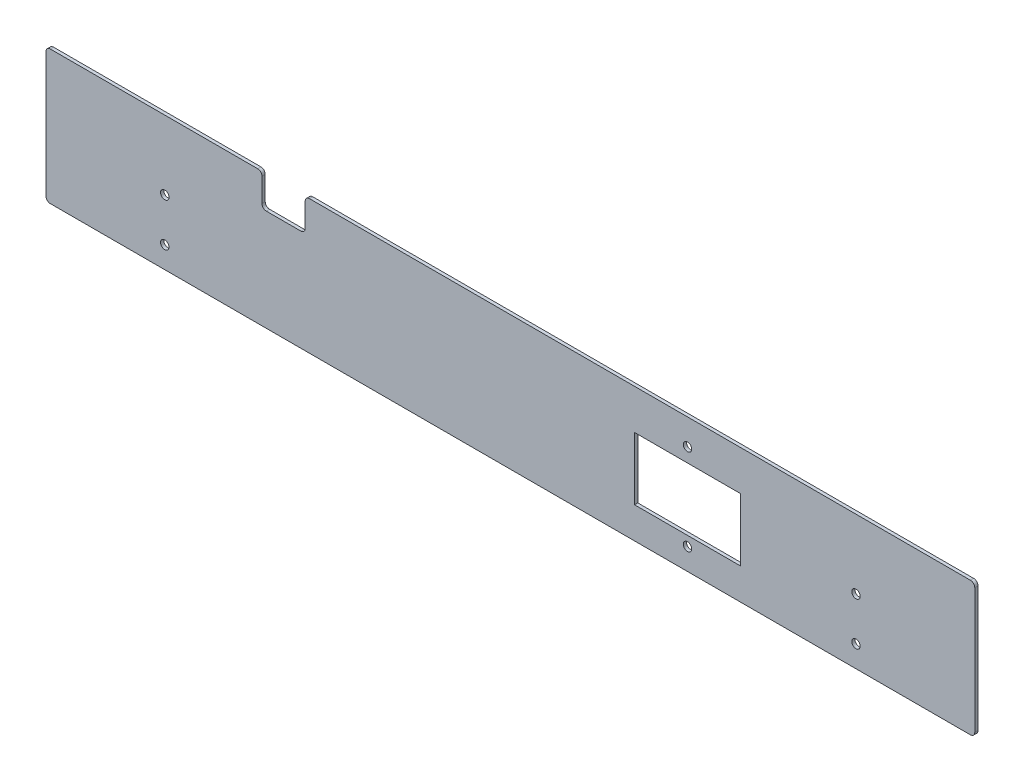
ISO-10303-21;
HEADER;
FILE_DESCRIPTION(('STEP AP214'),'2;1');
FILE_NAME('part.step','',(''),(''),'','','');
FILE_SCHEMA(('AUTOMOTIVE_DESIGN { 1 0 10303 214 1 1 1 1 }'));
ENDSEC;
DATA;
#1=APPLICATION_CONTEXT('core data for automotive mechanical design processes');
#2=APPLICATION_PROTOCOL_DEFINITION('international standard','automotive_design',2000,#1);
#3=PRODUCT_CONTEXT('',#1,'mechanical');
#4=PRODUCT('Part','Part','',(#3));
#5=PRODUCT_RELATED_PRODUCT_CATEGORY('part','',(#4));
#6=PRODUCT_DEFINITION_FORMATION('','',#4);
#7=PRODUCT_DEFINITION_CONTEXT('part definition',#1,'design');
#8=PRODUCT_DEFINITION('design','',#6,#7);
#9=PRODUCT_DEFINITION_SHAPE('','',#8);
#10=(LENGTH_UNIT() NAMED_UNIT(*) SI_UNIT(.MILLI.,.METRE.));
#11=(NAMED_UNIT(*) PLANE_ANGLE_UNIT() SI_UNIT($,.RADIAN.));
#12=(NAMED_UNIT(*) SI_UNIT($,.STERADIAN.) SOLID_ANGLE_UNIT());
#13=UNCERTAINTY_MEASURE_WITH_UNIT(LENGTH_MEASURE(1.E-05),#10,'distance_accuracy_value','');
#14=(GEOMETRIC_REPRESENTATION_CONTEXT(3) GLOBAL_UNCERTAINTY_ASSIGNED_CONTEXT((#13)) GLOBAL_UNIT_ASSIGNED_CONTEXT((#10,
#11,#12)) REPRESENTATION_CONTEXT('',''));
#15=CARTESIAN_POINT('',(0.,0.,0.));
#16=DIRECTION('',(0.,0.,1.));
#17=DIRECTION('',(1.,0.,0.));
#18=AXIS2_PLACEMENT_3D('',#15,#16,#17);
#19=CARTESIAN_POINT('',(0.,0.,1.5));
#20=DIRECTION('',(0.,0.,1.));
#21=DIRECTION('',(1.,0.,0.));
#22=AXIS2_PLACEMENT_3D('',#19,#20,#21);
#23=PLANE('',#22);
#24=CARTESIAN_POINT('',(23.0751881680108,-2.29648241206025,1.5));
#25=DIRECTION('',(0.,0.,1.));
#26=DIRECTION('',(1.,0.,0.));
#27=AXIS2_PLACEMENT_3D('',#24,#25,#26);
#28=CIRCLE('',#27,1.95);
#29=CARTESIAN_POINT('',(25.0251881680108,-2.29648241206025,1.5));
#30=VERTEX_POINT('',#29);
#31=EDGE_CURVE('E203',#30,#30,#28,.T.);
#32=ORIENTED_EDGE('',*,*,#31,.F.);
#33=EDGE_LOOP('',(#32));
#34=FACE_BOUND('',#33,.T.);
#35=CARTESIAN_POINT('',(-296.924811831989,-22.2964824120603,1.5));
#36=DIRECTION('',(0.,0.,1.));
#37=DIRECTION('',(1.,0.,0.));
#38=AXIS2_PLACEMENT_3D('',#35,#36,#37);
#39=CIRCLE('',#38,1.95000000000003);
#40=CARTESIAN_POINT('',(-294.974811831989,-22.2964824120603,1.5));
#41=VERTEX_POINT('',#40);
#42=EDGE_CURVE('E637',#41,#41,#39,.T.);
#43=ORIENTED_EDGE('',*,*,#42,.F.);
#44=EDGE_LOOP('',(#43));
#45=FACE_BOUND('',#44,.T.);
#46=CARTESIAN_POINT('',(-296.924811831989,-2.29648241206025,1.5));
#47=DIRECTION('',(0.,0.,1.));
#48=DIRECTION('',(1.,0.,0.));
#49=AXIS2_PLACEMENT_3D('',#46,#47,#48);
#50=CIRCLE('',#49,1.95000000000003);
#51=CARTESIAN_POINT('',(-294.974811831989,-2.29648241206025,1.5));
#52=VERTEX_POINT('',#51);
#53=EDGE_CURVE('E634',#52,#52,#50,.T.);
#54=ORIENTED_EDGE('',*,*,#53,.F.);
#55=EDGE_LOOP('',(#54));
#56=FACE_BOUND('',#55,.T.);
#57=CARTESIAN_POINT('',(23.0751881680108,-22.2964824120603,1.5));
#58=DIRECTION('',(0.,0.,1.));
#59=DIRECTION('',(1.,0.,0.));
#60=AXIS2_PLACEMENT_3D('',#57,#58,#59);
#61=CIRCLE('',#60,1.95);
#62=CARTESIAN_POINT('',(25.0251881680108,-22.2964824120603,1.5));
#63=VERTEX_POINT('',#62);
#64=EDGE_CURVE('E625',#63,#63,#61,.T.);
#65=ORIENTED_EDGE('',*,*,#64,.F.);
#66=EDGE_LOOP('',(#65));
#67=FACE_BOUND('',#66,.T.);
#68=CARTESIAN_POINT('',(-54.9248118319892,17.7035175879397,1.5));
#69=DIRECTION('',(0.,0.,1.));
#70=DIRECTION('',(1.,0.,0.));
#71=AXIS2_PLACEMENT_3D('',#68,#69,#70);
#72=CIRCLE('',#71,1.95);
#73=CARTESIAN_POINT('',(-52.9748118319892,17.7035175879397,1.5));
#74=VERTEX_POINT('',#73);
#75=EDGE_CURVE('E220',#74,#74,#72,.T.);
#76=ORIENTED_EDGE('',*,*,#75,.F.);
#77=EDGE_LOOP('',(#76));
#78=FACE_BOUND('',#77,.T.);
#79=DIRECTION('',(0.,1.,0.));
#80=VECTOR('',#79,1.);
#81=CARTESIAN_POINT('',(-251.924811831989,29.7035175879397,1.5));
#82=LINE('',#81,#80);
#83=CARTESIAN_POINT('',(-251.924811831989,16.7035175879397,1.5));
#84=VERTEX_POINT('',#83);
#85=CARTESIAN_POINT('',(-251.924811831989,27.7035175879397,1.5));
#86=VERTEX_POINT('',#85);
#87=EDGE_CURVE('E243',#84,#86,#82,.T.);
#88=ORIENTED_EDGE('',*,*,#87,.T.);
#89=CARTESIAN_POINT('',(-253.924811831989,27.7035175879397,1.5));
#90=DIRECTION('',(0.,0.,1.));
#91=DIRECTION('',(1.,0.,0.));
#92=AXIS2_PLACEMENT_3D('',#89,#90,#91);
#93=CIRCLE('',#92,2.);
#94=CARTESIAN_POINT('',(-253.924811831989,29.7035175879397,1.5));
#95=VERTEX_POINT('',#94);
#96=EDGE_CURVE('E311',#86,#95,#93,.T.);
#97=ORIENTED_EDGE('',*,*,#96,.T.);
#98=DIRECTION('',(-1.,0.,0.));
#99=VECTOR('',#98,1.);
#100=CARTESIAN_POINT('',(-351.924811831989,29.7035175879397,1.5));
#101=LINE('',#100,#99);
#102=CARTESIAN_POINT('',(-349.924811831989,29.7035175879397,1.5));
#103=VERTEX_POINT('',#102);
#104=EDGE_CURVE('E246',#95,#103,#101,.T.);
#105=ORIENTED_EDGE('',*,*,#104,.T.);
#106=CARTESIAN_POINT('',(-349.924811831989,27.7035175879397,1.5));
#107=DIRECTION('',(0.,0.,1.));
#108=DIRECTION('',(1.,0.,0.));
#109=AXIS2_PLACEMENT_3D('',#106,#107,#108);
#110=CIRCLE('',#109,2.);
#111=CARTESIAN_POINT('',(-351.924811831989,27.7035175879397,1.5));
#112=VERTEX_POINT('',#111);
#113=EDGE_CURVE('E302',#103,#112,#110,.T.);
#114=ORIENTED_EDGE('',*,*,#113,.T.);
#115=DIRECTION('',(0.,-1.,0.));
#116=VECTOR('',#115,1.);
#117=CARTESIAN_POINT('',(-351.924811831989,29.7035175879397,1.5));
#118=LINE('',#117,#116);
#119=CARTESIAN_POINT('',(-351.924811831989,-30.2964824120603,1.5));
#120=VERTEX_POINT('',#119);
#121=EDGE_CURVE('E226',#112,#120,#118,.T.);
#122=ORIENTED_EDGE('',*,*,#121,.T.);
#123=CARTESIAN_POINT('',(-349.924811831989,-30.2964824120603,1.5));
#124=DIRECTION('',(0.,0.,1.));
#125=DIRECTION('',(1.,0.,0.));
#126=AXIS2_PLACEMENT_3D('',#123,#124,#125);
#127=CIRCLE('',#126,2.);
#128=CARTESIAN_POINT('',(-349.924811831989,-32.2964824120603,1.5));
#129=VERTEX_POINT('',#128);
#130=EDGE_CURVE('E304',#120,#129,#127,.T.);
#131=ORIENTED_EDGE('',*,*,#130,.T.);
#132=DIRECTION('',(1.,0.,0.));
#133=VECTOR('',#132,1.);
#134=CARTESIAN_POINT('',(-351.924811831989,-32.2964824120603,1.5));
#135=LINE('',#134,#133);
#136=CARTESIAN_POINT('',(76.0751881680108,-32.2964824120603,1.5));
#137=VERTEX_POINT('',#136);
#138=EDGE_CURVE('E229',#129,#137,#135,.T.);
#139=ORIENTED_EDGE('',*,*,#138,.T.);
#140=CARTESIAN_POINT('',(76.0751881680108,-30.2964824120603,1.5));
#141=DIRECTION('',(0.,0.,1.));
#142=DIRECTION('',(1.,0.,0.));
#143=AXIS2_PLACEMENT_3D('',#140,#141,#142);
#144=CIRCLE('',#143,2.);
#145=CARTESIAN_POINT('',(78.0751881680108,-30.2964824120603,1.5));
#146=VERTEX_POINT('',#145);
#147=EDGE_CURVE('E306',#137,#146,#144,.T.);
#148=ORIENTED_EDGE('',*,*,#147,.T.);
#149=DIRECTION('',(0.,1.,0.));
#150=VECTOR('',#149,1.);
#151=CARTESIAN_POINT('',(78.0751881680108,29.7035175879397,1.5));
#152=LINE('',#151,#150);
#153=CARTESIAN_POINT('',(78.0751881680108,27.7035175879397,1.5));
#154=VERTEX_POINT('',#153);
#155=EDGE_CURVE('E233',#146,#154,#152,.T.);
#156=ORIENTED_EDGE('',*,*,#155,.T.);
#157=CARTESIAN_POINT('',(76.0751881680108,27.7035175879397,1.5));
#158=DIRECTION('',(0.,0.,1.));
#159=DIRECTION('',(1.,0.,0.));
#160=AXIS2_PLACEMENT_3D('',#157,#158,#159);
#161=CIRCLE('',#160,2.);
#162=CARTESIAN_POINT('',(76.0751881680108,29.7035175879397,1.5));
#163=VERTEX_POINT('',#162);
#164=EDGE_CURVE('E54',#154,#163,#161,.T.);
#165=ORIENTED_EDGE('',*,*,#164,.T.);
#166=DIRECTION('',(-1.,0.,0.));
#167=VECTOR('',#166,1.);
#168=CARTESIAN_POINT('',(-231.924811831989,29.7035175879397,1.5));
#169=LINE('',#168,#167);
#170=CARTESIAN_POINT('',(-229.924811831989,29.7035175879397,1.5));
#171=VERTEX_POINT('',#170);
#172=EDGE_CURVE('E235',#163,#171,#169,.T.);
#173=ORIENTED_EDGE('',*,*,#172,.T.);
#174=CARTESIAN_POINT('',(-229.924811831989,27.7035175879397,1.5));
#175=DIRECTION('',(0.,0.,1.));
#176=DIRECTION('',(1.,0.,0.));
#177=AXIS2_PLACEMENT_3D('',#174,#175,#176);
#178=CIRCLE('',#177,2.);
#179=CARTESIAN_POINT('',(-231.924811831989,27.7035175879397,1.5));
#180=VERTEX_POINT('',#179);
#181=EDGE_CURVE('E309',#171,#180,#178,.T.);
#182=ORIENTED_EDGE('',*,*,#181,.T.);
#183=DIRECTION('',(0.,-1.,0.));
#184=VECTOR('',#183,1.);
#185=CARTESIAN_POINT('',(-231.924811831989,29.7035175879397,1.5));
#186=LINE('',#185,#184);
#187=CARTESIAN_POINT('',(-231.924811831989,16.7035175879397,1.5));
#188=VERTEX_POINT('',#187);
#189=EDGE_CURVE('E237',#180,#188,#186,.T.);
#190=ORIENTED_EDGE('',*,*,#189,.T.);
#191=CARTESIAN_POINT('',(-233.924811831989,16.7035175879397,1.5));
#192=DIRECTION('',(0.,0.,1.));
#193=DIRECTION('',(1.,0.,0.));
#194=AXIS2_PLACEMENT_3D('',#191,#192,#193);
#195=CIRCLE('',#194,2.);
#196=CARTESIAN_POINT('',(-233.924811831989,14.7035175879397,1.5));
#197=VERTEX_POINT('',#196);
#198=EDGE_CURVE('E334',#188,#197,#195,.F.);
#199=ORIENTED_EDGE('',*,*,#198,.T.);
#200=DIRECTION('',(-1.,0.,0.));
#201=VECTOR('',#200,1.);
#202=CARTESIAN_POINT('',(-231.924811831989,14.7035175879397,1.5));
#203=LINE('',#202,#201);
#204=CARTESIAN_POINT('',(-249.924811831989,14.7035175879397,1.5));
#205=VERTEX_POINT('',#204);
#206=EDGE_CURVE('E240',#197,#205,#203,.T.);
#207=ORIENTED_EDGE('',*,*,#206,.T.);
#208=CARTESIAN_POINT('',(-249.924811831989,16.7035175879397,1.5));
#209=DIRECTION('',(0.,0.,1.));
#210=DIRECTION('',(1.,0.,0.));
#211=AXIS2_PLACEMENT_3D('',#208,#209,#210);
#212=CIRCLE('',#211,2.);
#213=EDGE_CURVE('E11',#205,#84,#212,.F.);
#214=ORIENTED_EDGE('',*,*,#213,.T.);
#215=EDGE_LOOP('',(#88,#97,#105,#114,#122,#131,#139,#148,#156,#165,#173,#182,#190,#199,#207,#214));
#216=FACE_BOUND('',#215,.T.);
#217=CARTESIAN_POINT('',(-54.9248118319892,-22.2964824120603,1.5));
#218=DIRECTION('',(0.,0.,1.));
#219=DIRECTION('',(1.,0.,0.));
#220=AXIS2_PLACEMENT_3D('',#217,#218,#219);
#221=CIRCLE('',#220,1.95);
#222=CARTESIAN_POINT('',(-52.9748118319892,-22.2964824120603,1.5));
#223=VERTEX_POINT('',#222);
#224=EDGE_CURVE('E214',#223,#223,#221,.T.);
#225=ORIENTED_EDGE('',*,*,#224,.F.);
#226=EDGE_LOOP('',(#225));
#227=FACE_BOUND('',#226,.T.);
#228=DIRECTION('',(1.,0.,0.));
#229=VECTOR('',#228,1.);
#230=CARTESIAN_POINT('',(-79.4248118319892,-17.7964824120603,1.5));
#231=LINE('',#230,#229);
#232=CARTESIAN_POINT('',(-79.4248118319892,-17.7964824120603,1.5));
#233=VERTEX_POINT('',#232);
#234=CARTESIAN_POINT('',(-30.4248118319892,-17.7964824120603,1.5));
#235=VERTEX_POINT('',#234);
#236=EDGE_CURVE('E181',#233,#235,#231,.T.);
#237=ORIENTED_EDGE('',*,*,#236,.F.);
#238=DIRECTION('',(0.,-1.,0.));
#239=VECTOR('',#238,1.);
#240=CARTESIAN_POINT('',(-79.4248118319892,11.2035175879397,1.5));
#241=LINE('',#240,#239);
#242=CARTESIAN_POINT('',(-79.4248118319892,11.2035175879397,1.5));
#243=VERTEX_POINT('',#242);
#244=EDGE_CURVE('E171',#243,#233,#241,.T.);
#245=ORIENTED_EDGE('',*,*,#244,.F.);
#246=DIRECTION('',(-1.,0.,0.));
#247=VECTOR('',#246,1.);
#248=CARTESIAN_POINT('',(-79.4248118319892,11.2035175879397,1.5));
#249=LINE('',#248,#247);
#250=CARTESIAN_POINT('',(-30.4248118319892,11.2035175879397,1.5));
#251=VERTEX_POINT('',#250);
#252=EDGE_CURVE('E196',#251,#243,#249,.T.);
#253=ORIENTED_EDGE('',*,*,#252,.F.);
#254=DIRECTION('',(0.,1.,0.));
#255=VECTOR('',#254,1.);
#256=CARTESIAN_POINT('',(-30.4248118319892,11.2035175879397,1.5));
#257=LINE('',#256,#255);
#258=EDGE_CURVE('E194',#235,#251,#257,.T.);
#259=ORIENTED_EDGE('',*,*,#258,.F.);
#260=EDGE_LOOP('',(#237,#245,#253,#259));
#261=FACE_BOUND('',#260,.T.);
#262=ADVANCED_FACE('F32',(#34,#45,#56,#67,#78,#216,#227,#261),#23,.T.);
#263=CARTESIAN_POINT('',(0.,0.,0.));
#264=DIRECTION('',(0.,0.,1.));
#265=DIRECTION('',(1.,0.,0.));
#266=AXIS2_PLACEMENT_3D('',#263,#264,#265);
#267=PLANE('',#266);
#268=CARTESIAN_POINT('',(23.0751881680108,-2.29648241206025,0.));
#269=DIRECTION('',(0.,0.,-1.));
#270=DIRECTION('',(-1.,0.,0.));
#271=AXIS2_PLACEMENT_3D('',#268,#269,#270);
#272=CIRCLE('',#271,1.95);
#273=CARTESIAN_POINT('',(21.1251881680108,-2.29648241206025,0.));
#274=VERTEX_POINT('',#273);
#275=EDGE_CURVE('E620',#274,#274,#272,.T.);
#276=ORIENTED_EDGE('',*,*,#275,.F.);
#277=EDGE_LOOP('',(#276));
#278=FACE_BOUND('',#277,.T.);
#279=CARTESIAN_POINT('',(-296.924811831989,-22.2964824120603,0.));
#280=DIRECTION('',(0.,0.,-1.));
#281=DIRECTION('',(-1.,0.,0.));
#282=AXIS2_PLACEMENT_3D('',#279,#280,#281);
#283=CIRCLE('',#282,1.95000000000003);
#284=CARTESIAN_POINT('',(-298.874811831989,-22.2964824120603,0.));
#285=VERTEX_POINT('',#284);
#286=EDGE_CURVE('E622',#285,#285,#283,.T.);
#287=ORIENTED_EDGE('',*,*,#286,.F.);
#288=EDGE_LOOP('',(#287));
#289=FACE_BOUND('',#288,.T.);
#290=CARTESIAN_POINT('',(-296.924811831989,-2.29648241206025,0.));
#291=DIRECTION('',(0.,0.,-1.));
#292=DIRECTION('',(-1.,0.,0.));
#293=AXIS2_PLACEMENT_3D('',#290,#291,#292);
#294=CIRCLE('',#293,1.95000000000003);
#295=CARTESIAN_POINT('',(-298.874811831989,-2.29648241206025,0.));
#296=VERTEX_POINT('',#295);
#297=EDGE_CURVE('E628',#296,#296,#294,.T.);
#298=ORIENTED_EDGE('',*,*,#297,.F.);
#299=EDGE_LOOP('',(#298));
#300=FACE_BOUND('',#299,.T.);
#301=CARTESIAN_POINT('',(23.0751881680108,-22.2964824120603,0.));
#302=DIRECTION('',(0.,0.,-1.));
#303=DIRECTION('',(-1.,0.,0.));
#304=AXIS2_PLACEMENT_3D('',#301,#302,#303);
#305=CIRCLE('',#304,1.95);
#306=CARTESIAN_POINT('',(21.1251881680108,-22.2964824120603,0.));
#307=VERTEX_POINT('',#306);
#308=EDGE_CURVE('E621',#307,#307,#305,.T.);
#309=ORIENTED_EDGE('',*,*,#308,.F.);
#310=EDGE_LOOP('',(#309));
#311=FACE_BOUND('',#310,.T.);
#312=CARTESIAN_POINT('',(-54.9248118319892,-22.2964824120603,0.));
#313=DIRECTION('',(0.,0.,1.));
#314=DIRECTION('',(1.,0.,0.));
#315=AXIS2_PLACEMENT_3D('',#312,#313,#314);
#316=CIRCLE('',#315,1.95);
#317=CARTESIAN_POINT('',(-52.9748118319892,-22.2964824120603,0.));
#318=VERTEX_POINT('',#317);
#319=EDGE_CURVE('E189',#318,#318,#316,.T.);
#320=ORIENTED_EDGE('',*,*,#319,.T.);
#321=EDGE_LOOP('',(#320));
#322=FACE_BOUND('',#321,.T.);
#323=CARTESIAN_POINT('',(-54.9248118319892,17.7035175879397,0.));
#324=DIRECTION('',(0.,0.,1.));
#325=DIRECTION('',(1.,0.,0.));
#326=AXIS2_PLACEMENT_3D('',#323,#324,#325);
#327=CIRCLE('',#326,1.95);
#328=CARTESIAN_POINT('',(-52.9748118319892,17.7035175879397,0.));
#329=VERTEX_POINT('',#328);
#330=EDGE_CURVE('E217',#329,#329,#327,.T.);
#331=ORIENTED_EDGE('',*,*,#330,.T.);
#332=EDGE_LOOP('',(#331));
#333=FACE_BOUND('',#332,.T.);
#334=DIRECTION('',(-1.,0.,0.));
#335=VECTOR('',#334,1.);
#336=CARTESIAN_POINT('',(-351.924811831989,29.7035175879397,0.));
#337=LINE('',#336,#335);
#338=CARTESIAN_POINT('',(-253.924811831989,29.7035175879397,0.));
#339=VERTEX_POINT('',#338);
#340=CARTESIAN_POINT('',(-349.924811831989,29.7035175879397,0.));
#341=VERTEX_POINT('',#340);
#342=EDGE_CURVE('E230',#339,#341,#337,.T.);
#343=ORIENTED_EDGE('',*,*,#342,.F.);
#344=CARTESIAN_POINT('',(-253.924811831989,27.7035175879397,0.));
#345=DIRECTION('',(0.,0.,1.));
#346=DIRECTION('',(1.,0.,0.));
#347=AXIS2_PLACEMENT_3D('',#344,#345,#346);
#348=CIRCLE('',#347,2.);
#349=CARTESIAN_POINT('',(-251.924811831989,27.7035175879397,0.));
#350=VERTEX_POINT('',#349);
#351=EDGE_CURVE('E300',#339,#350,#348,.F.);
#352=ORIENTED_EDGE('',*,*,#351,.T.);
#353=DIRECTION('',(0.,1.,0.));
#354=VECTOR('',#353,1.);
#355=CARTESIAN_POINT('',(-251.924811831989,29.7035175879397,0.));
#356=LINE('',#355,#354);
#357=CARTESIAN_POINT('',(-251.924811831989,16.7035175879397,0.));
#358=VERTEX_POINT('',#357);
#359=EDGE_CURVE('E266',#358,#350,#356,.T.);
#360=ORIENTED_EDGE('',*,*,#359,.F.);
#361=CARTESIAN_POINT('',(-249.924811831989,16.7035175879397,0.));
#362=DIRECTION('',(0.,0.,1.));
#363=DIRECTION('',(1.,0.,0.));
#364=AXIS2_PLACEMENT_3D('',#361,#362,#363);
#365=CIRCLE('',#364,2.);
#366=CARTESIAN_POINT('',(-249.924811831989,14.7035175879397,0.));
#367=VERTEX_POINT('',#366);
#368=EDGE_CURVE('E40',#358,#367,#365,.T.);
#369=ORIENTED_EDGE('',*,*,#368,.T.);
#370=DIRECTION('',(-1.,0.,0.));
#371=VECTOR('',#370,1.);
#372=CARTESIAN_POINT('',(-231.924811831989,14.7035175879397,0.));
#373=LINE('',#372,#371);
#374=CARTESIAN_POINT('',(-233.924811831989,14.7035175879397,0.));
#375=VERTEX_POINT('',#374);
#376=EDGE_CURVE('E263',#375,#367,#373,.T.);
#377=ORIENTED_EDGE('',*,*,#376,.F.);
#378=CARTESIAN_POINT('',(-233.924811831989,16.7035175879397,0.));
#379=DIRECTION('',(0.,0.,1.));
#380=DIRECTION('',(1.,0.,0.));
#381=AXIS2_PLACEMENT_3D('',#378,#379,#380);
#382=CIRCLE('',#381,2.);
#383=CARTESIAN_POINT('',(-231.924811831989,16.7035175879397,0.));
#384=VERTEX_POINT('',#383);
#385=EDGE_CURVE('E332',#375,#384,#382,.T.);
#386=ORIENTED_EDGE('',*,*,#385,.T.);
#387=DIRECTION('',(0.,-1.,0.));
#388=VECTOR('',#387,1.);
#389=CARTESIAN_POINT('',(-231.924811831989,29.7035175879397,0.));
#390=LINE('',#389,#388);
#391=CARTESIAN_POINT('',(-231.924811831989,27.7035175879397,0.));
#392=VERTEX_POINT('',#391);
#393=EDGE_CURVE('E260',#392,#384,#390,.T.);
#394=ORIENTED_EDGE('',*,*,#393,.F.);
#395=CARTESIAN_POINT('',(-229.924811831989,27.7035175879397,0.));
#396=DIRECTION('',(0.,0.,1.));
#397=DIRECTION('',(1.,0.,0.));
#398=AXIS2_PLACEMENT_3D('',#395,#396,#397);
#399=CIRCLE('',#398,2.);
#400=CARTESIAN_POINT('',(-229.924811831989,29.7035175879397,0.));
#401=VERTEX_POINT('',#400);
#402=EDGE_CURVE('E298',#392,#401,#399,.F.);
#403=ORIENTED_EDGE('',*,*,#402,.T.);
#404=DIRECTION('',(-1.,0.,0.));
#405=VECTOR('',#404,1.);
#406=CARTESIAN_POINT('',(-231.924811831989,29.7035175879397,0.));
#407=LINE('',#406,#405);
#408=CARTESIAN_POINT('',(76.0751881680108,29.7035175879397,0.));
#409=VERTEX_POINT('',#408);
#410=EDGE_CURVE('E258',#409,#401,#407,.T.);
#411=ORIENTED_EDGE('',*,*,#410,.F.);
#412=CARTESIAN_POINT('',(76.0751881680108,27.7035175879397,0.));
#413=DIRECTION('',(0.,0.,1.));
#414=DIRECTION('',(1.,0.,0.));
#415=AXIS2_PLACEMENT_3D('',#412,#413,#414);
#416=CIRCLE('',#415,2.);
#417=CARTESIAN_POINT('',(78.0751881680108,27.7035175879397,0.));
#418=VERTEX_POINT('',#417);
#419=EDGE_CURVE('E296',#409,#418,#416,.F.);
#420=ORIENTED_EDGE('',*,*,#419,.T.);
#421=DIRECTION('',(0.,1.,0.));
#422=VECTOR('',#421,1.);
#423=CARTESIAN_POINT('',(78.0751881680108,29.7035175879397,0.));
#424=LINE('',#423,#422);
#425=CARTESIAN_POINT('',(78.0751881680108,-30.2964824120603,0.));
#426=VERTEX_POINT('',#425);
#427=EDGE_CURVE('E255',#426,#418,#424,.T.);
#428=ORIENTED_EDGE('',*,*,#427,.F.);
#429=CARTESIAN_POINT('',(76.0751881680108,-30.2964824120603,0.));
#430=DIRECTION('',(0.,0.,1.));
#431=DIRECTION('',(1.,0.,0.));
#432=AXIS2_PLACEMENT_3D('',#429,#430,#431);
#433=CIRCLE('',#432,2.);
#434=CARTESIAN_POINT('',(76.0751881680108,-32.2964824120603,0.));
#435=VERTEX_POINT('',#434);
#436=EDGE_CURVE('E294',#426,#435,#433,.F.);
#437=ORIENTED_EDGE('',*,*,#436,.T.);
#438=DIRECTION('',(1.,0.,0.));
#439=VECTOR('',#438,1.);
#440=CARTESIAN_POINT('',(-351.924811831989,-32.2964824120603,0.));
#441=LINE('',#440,#439);
#442=CARTESIAN_POINT('',(-349.924811831989,-32.2964824120603,0.));
#443=VERTEX_POINT('',#442);
#444=EDGE_CURVE('E252',#443,#435,#441,.T.);
#445=ORIENTED_EDGE('',*,*,#444,.F.);
#446=CARTESIAN_POINT('',(-349.924811831989,-30.2964824120603,0.));
#447=DIRECTION('',(0.,0.,1.));
#448=DIRECTION('',(1.,0.,0.));
#449=AXIS2_PLACEMENT_3D('',#446,#447,#448);
#450=CIRCLE('',#449,2.);
#451=CARTESIAN_POINT('',(-351.924811831989,-30.2964824120603,0.));
#452=VERTEX_POINT('',#451);
#453=EDGE_CURVE('E292',#443,#452,#450,.F.);
#454=ORIENTED_EDGE('',*,*,#453,.T.);
#455=DIRECTION('',(0.,-1.,0.));
#456=VECTOR('',#455,1.);
#457=CARTESIAN_POINT('',(-351.924811831989,29.7035175879397,0.));
#458=LINE('',#457,#456);
#459=CARTESIAN_POINT('',(-351.924811831989,27.7035175879397,0.));
#460=VERTEX_POINT('',#459);
#461=EDGE_CURVE('E223',#460,#452,#458,.T.);
#462=ORIENTED_EDGE('',*,*,#461,.F.);
#463=CARTESIAN_POINT('',(-349.924811831989,27.7035175879397,0.));
#464=DIRECTION('',(0.,0.,1.));
#465=DIRECTION('',(1.,0.,0.));
#466=AXIS2_PLACEMENT_3D('',#463,#464,#465);
#467=CIRCLE('',#466,2.);
#468=EDGE_CURVE('E290',#460,#341,#467,.F.);
#469=ORIENTED_EDGE('',*,*,#468,.T.);
#470=EDGE_LOOP('',(#343,#352,#360,#369,#377,#386,#394,#403,#411,#420,#428,#437,#445,#454,#462,#469));
#471=FACE_BOUND('',#470,.T.);
#472=DIRECTION('',(0.,-1.,0.));
#473=VECTOR('',#472,1.);
#474=CARTESIAN_POINT('',(-79.4248118319892,11.2035175879397,0.));
#475=LINE('',#474,#473);
#476=CARTESIAN_POINT('',(-79.4248118319892,11.2035175879397,0.));
#477=VERTEX_POINT('',#476);
#478=CARTESIAN_POINT('',(-79.4248118319892,-17.7964824120603,0.));
#479=VERTEX_POINT('',#478);
#480=EDGE_CURVE('E201',#477,#479,#475,.T.);
#481=ORIENTED_EDGE('',*,*,#480,.T.);
#482=DIRECTION('',(1.,0.,0.));
#483=VECTOR('',#482,1.);
#484=CARTESIAN_POINT('',(-79.4248118319892,-17.7964824120603,0.));
#485=LINE('',#484,#483);
#486=CARTESIAN_POINT('',(-30.4248118319892,-17.7964824120603,0.));
#487=VERTEX_POINT('',#486);
#488=EDGE_CURVE('E188',#479,#487,#485,.T.);
#489=ORIENTED_EDGE('',*,*,#488,.T.);
#490=DIRECTION('',(0.,1.,0.));
#491=VECTOR('',#490,1.);
#492=CARTESIAN_POINT('',(-30.4248118319892,11.2035175879397,0.));
#493=LINE('',#492,#491);
#494=CARTESIAN_POINT('',(-30.4248118319892,11.2035175879397,0.));
#495=VERTEX_POINT('',#494);
#496=EDGE_CURVE('E205',#487,#495,#493,.T.);
#497=ORIENTED_EDGE('',*,*,#496,.T.);
#498=DIRECTION('',(-1.,0.,0.));
#499=VECTOR('',#498,1.);
#500=CARTESIAN_POINT('',(-79.4248118319892,11.2035175879397,0.));
#501=LINE('',#500,#499);
#502=EDGE_CURVE('E182',#495,#477,#501,.T.);
#503=ORIENTED_EDGE('',*,*,#502,.T.);
#504=EDGE_LOOP('',(#481,#489,#497,#503));
#505=FACE_BOUND('',#504,.T.);
#506=ADVANCED_FACE('F339',(#278,#289,#300,#311,#322,#333,#471,#505),#267,.F.);
#507=CARTESIAN_POINT('',(-351.924811831989,29.7035175879397,1.5));
#508=DIRECTION('',(1.,0.,0.));
#509=DIRECTION('',(0.,0.,-1.));
#510=AXIS2_PLACEMENT_3D('',#507,#508,#509);
#511=PLANE('',#510);
#512=ORIENTED_EDGE('',*,*,#461,.T.);
#513=DIRECTION('',(0.,0.,-1.));
#514=VECTOR('',#513,1.);
#515=CARTESIAN_POINT('',(-351.924811831989,-30.2964824120603,1.5));
#516=LINE('',#515,#514);
#517=EDGE_CURVE('E330',#452,#120,#516,.F.);
#518=ORIENTED_EDGE('',*,*,#517,.T.);
#519=ORIENTED_EDGE('',*,*,#121,.F.);
#520=DIRECTION('',(0.,0.,-1.));
#521=VECTOR('',#520,1.);
#522=CARTESIAN_POINT('',(-351.924811831989,27.7035175879397,1.5));
#523=LINE('',#522,#521);
#524=EDGE_CURVE('E327',#112,#460,#523,.T.);
#525=ORIENTED_EDGE('',*,*,#524,.T.);
#526=EDGE_LOOP('',(#512,#518,#519,#525));
#527=FACE_BOUND('',#526,.T.);
#528=ADVANCED_FACE('F369',(#527),#511,.F.);
#529=CARTESIAN_POINT('',(-351.924811831989,-32.2964824120603,1.5));
#530=DIRECTION('',(0.,1.,0.));
#531=DIRECTION('',(0.,0.,1.));
#532=AXIS2_PLACEMENT_3D('',#529,#530,#531);
#533=PLANE('',#532);
#534=ORIENTED_EDGE('',*,*,#444,.T.);
#535=DIRECTION('',(0.,0.,-1.));
#536=VECTOR('',#535,1.);
#537=CARTESIAN_POINT('',(76.0751881680108,-32.2964824120603,1.5));
#538=LINE('',#537,#536);
#539=EDGE_CURVE('E325',#435,#137,#538,.F.);
#540=ORIENTED_EDGE('',*,*,#539,.T.);
#541=ORIENTED_EDGE('',*,*,#138,.F.);
#542=DIRECTION('',(0.,0.,-1.));
#543=VECTOR('',#542,1.);
#544=CARTESIAN_POINT('',(-349.924811831989,-32.2964824120603,1.5));
#545=LINE('',#544,#543);
#546=EDGE_CURVE('E322',#129,#443,#545,.T.);
#547=ORIENTED_EDGE('',*,*,#546,.T.);
#548=EDGE_LOOP('',(#534,#540,#541,#547));
#549=FACE_BOUND('',#548,.T.);
#550=ADVANCED_FACE('F378',(#549),#533,.F.);
#551=CARTESIAN_POINT('',(78.0751881680108,29.7035175879397,1.5));
#552=DIRECTION('',(-1.,0.,0.));
#553=DIRECTION('',(0.,0.,1.));
#554=AXIS2_PLACEMENT_3D('',#551,#552,#553);
#555=PLANE('',#554);
#556=ORIENTED_EDGE('',*,*,#427,.T.);
#557=DIRECTION('',(0.,0.,-1.));
#558=VECTOR('',#557,1.);
#559=CARTESIAN_POINT('',(78.0751881680108,27.7035175879397,1.5));
#560=LINE('',#559,#558);
#561=EDGE_CURVE('E320',#418,#154,#560,.F.);
#562=ORIENTED_EDGE('',*,*,#561,.T.);
#563=ORIENTED_EDGE('',*,*,#155,.F.);
#564=DIRECTION('',(0.,0.,-1.));
#565=VECTOR('',#564,1.);
#566=CARTESIAN_POINT('',(78.0751881680108,-30.2964824120603,1.5));
#567=LINE('',#566,#565);
#568=EDGE_CURVE('E317',#146,#426,#567,.T.);
#569=ORIENTED_EDGE('',*,*,#568,.T.);
#570=EDGE_LOOP('',(#556,#562,#563,#569));
#571=FACE_BOUND('',#570,.T.);
#572=ADVANCED_FACE('F386',(#571),#555,.F.);
#573=CARTESIAN_POINT('',(-231.924811831989,29.7035175879397,1.5));
#574=DIRECTION('',(0.,-1.,0.));
#575=DIRECTION('',(1.,0.,0.));
#576=AXIS2_PLACEMENT_3D('',#573,#574,#575);
#577=PLANE('',#576);
#578=ORIENTED_EDGE('',*,*,#410,.T.);
#579=DIRECTION('',(0.,0.,-1.));
#580=VECTOR('',#579,1.);
#581=CARTESIAN_POINT('',(-229.924811831989,29.7035175879397,1.5));
#582=LINE('',#581,#580);
#583=EDGE_CURVE('E47',#401,#171,#582,.F.);
#584=ORIENTED_EDGE('',*,*,#583,.T.);
#585=ORIENTED_EDGE('',*,*,#172,.F.);
#586=DIRECTION('',(0.,0.,-1.));
#587=VECTOR('',#586,1.);
#588=CARTESIAN_POINT('',(76.0751881680108,29.7035175879397,1.5));
#589=LINE('',#588,#587);
#590=EDGE_CURVE('E313',#163,#409,#589,.T.);
#591=ORIENTED_EDGE('',*,*,#590,.T.);
#592=EDGE_LOOP('',(#578,#584,#585,#591));
#593=FACE_BOUND('',#592,.T.);
#594=ADVANCED_FACE('F393',(#593),#577,.F.);
#595=CARTESIAN_POINT('',(-231.924811831989,29.7035175879397,1.5));
#596=DIRECTION('',(1.,0.,0.));
#597=DIRECTION('',(0.,0.,-1.));
#598=AXIS2_PLACEMENT_3D('',#595,#596,#597);
#599=PLANE('',#598);
#600=ORIENTED_EDGE('',*,*,#393,.T.);
#601=DIRECTION('',(0.,0.,-1.));
#602=VECTOR('',#601,1.);
#603=CARTESIAN_POINT('',(-231.924811831989,16.7035175879397,1.5));
#604=LINE('',#603,#602);
#605=EDGE_CURVE('E278',#384,#188,#604,.F.);
#606=ORIENTED_EDGE('',*,*,#605,.T.);
#607=ORIENTED_EDGE('',*,*,#189,.F.);
#608=DIRECTION('',(0.,0.,-1.));
#609=VECTOR('',#608,1.);
#610=CARTESIAN_POINT('',(-231.924811831989,27.7035175879397,1.5));
#611=LINE('',#610,#609);
#612=EDGE_CURVE('E275',#180,#392,#611,.T.);
#613=ORIENTED_EDGE('',*,*,#612,.T.);
#614=EDGE_LOOP('',(#600,#606,#607,#613));
#615=FACE_BOUND('',#614,.T.);
#616=ADVANCED_FACE('F401',(#615),#599,.F.);
#617=CARTESIAN_POINT('',(-231.924811831989,14.7035175879397,1.5));
#618=DIRECTION('',(0.,-1.,0.));
#619=DIRECTION('',(1.,0.,0.));
#620=AXIS2_PLACEMENT_3D('',#617,#618,#619);
#621=PLANE('',#620);
#622=ORIENTED_EDGE('',*,*,#206,.F.);
#623=DIRECTION('',(0.,0.,-1.));
#624=VECTOR('',#623,1.);
#625=CARTESIAN_POINT('',(-233.924811831989,14.7035175879397,0.));
#626=LINE('',#625,#624);
#627=EDGE_CURVE('E272',#197,#375,#626,.T.);
#628=ORIENTED_EDGE('',*,*,#627,.T.);
#629=ORIENTED_EDGE('',*,*,#376,.T.);
#630=DIRECTION('',(0.,0.,-1.));
#631=VECTOR('',#630,1.);
#632=CARTESIAN_POINT('',(-249.924811831989,14.7035175879397,1.5));
#633=LINE('',#632,#631);
#634=EDGE_CURVE('E249',#367,#205,#633,.F.);
#635=ORIENTED_EDGE('',*,*,#634,.T.);
#636=EDGE_LOOP('',(#622,#628,#629,#635));
#637=FACE_BOUND('',#636,.T.);
#638=ADVANCED_FACE('F346',(#637),#621,.F.);
#639=CARTESIAN_POINT('',(-251.924811831989,29.7035175879397,1.5));
#640=DIRECTION('',(-1.,0.,0.));
#641=DIRECTION('',(0.,0.,1.));
#642=AXIS2_PLACEMENT_3D('',#639,#640,#641);
#643=PLANE('',#642);
#644=ORIENTED_EDGE('',*,*,#87,.F.);
#645=DIRECTION('',(0.,0.,-1.));
#646=VECTOR('',#645,1.);
#647=CARTESIAN_POINT('',(-251.924811831989,16.7035175879397,0.));
#648=LINE('',#647,#646);
#649=EDGE_CURVE('E282',#84,#358,#648,.T.);
#650=ORIENTED_EDGE('',*,*,#649,.T.);
#651=ORIENTED_EDGE('',*,*,#359,.T.);
#652=DIRECTION('',(0.,0.,-1.));
#653=VECTOR('',#652,1.);
#654=CARTESIAN_POINT('',(-251.924811831989,27.7035175879397,1.5));
#655=LINE('',#654,#653);
#656=EDGE_CURVE('E280',#350,#86,#655,.F.);
#657=ORIENTED_EDGE('',*,*,#656,.T.);
#658=EDGE_LOOP('',(#644,#650,#651,#657));
#659=FACE_BOUND('',#658,.T.);
#660=ADVANCED_FACE('F354',(#659),#643,.F.);
#661=CARTESIAN_POINT('',(-351.924811831989,29.7035175879397,1.5));
#662=DIRECTION('',(0.,-1.,0.));
#663=DIRECTION('',(1.,0.,0.));
#664=AXIS2_PLACEMENT_3D('',#661,#662,#663);
#665=PLANE('',#664);
#666=ORIENTED_EDGE('',*,*,#104,.F.);
#667=DIRECTION('',(0.,0.,-1.));
#668=VECTOR('',#667,1.);
#669=CARTESIAN_POINT('',(-253.924811831989,29.7035175879397,1.5));
#670=LINE('',#669,#668);
#671=EDGE_CURVE('E287',#95,#339,#670,.T.);
#672=ORIENTED_EDGE('',*,*,#671,.T.);
#673=ORIENTED_EDGE('',*,*,#342,.T.);
#674=DIRECTION('',(0.,0.,-1.));
#675=VECTOR('',#674,1.);
#676=CARTESIAN_POINT('',(-349.924811831989,29.7035175879397,1.5));
#677=LINE('',#676,#675);
#678=EDGE_CURVE('E285',#341,#103,#677,.F.);
#679=ORIENTED_EDGE('',*,*,#678,.T.);
#680=EDGE_LOOP('',(#666,#672,#673,#679));
#681=FACE_BOUND('',#680,.T.);
#682=ADVANCED_FACE('F362',(#681),#665,.F.);
#683=CARTESIAN_POINT('',(-54.9248118319892,17.7035175879397,1.5));
#684=DIRECTION('',(0.,0.,-1.));
#685=DIRECTION('',(-1.,0.,0.));
#686=AXIS2_PLACEMENT_3D('',#683,#684,#685);
#687=CYLINDRICAL_SURFACE('',#686,1.95);
#688=ORIENTED_EDGE('',*,*,#75,.T.);
#689=EDGE_LOOP('',(#688));
#690=FACE_BOUND('',#689,.T.);
#691=ORIENTED_EDGE('',*,*,#330,.F.);
#692=EDGE_LOOP('',(#691));
#693=FACE_BOUND('',#692,.T.);
#694=ADVANCED_FACE('F429',(#690,#693),#687,.F.);
#695=CARTESIAN_POINT('',(-54.9248118319892,-22.2964824120603,1.5));
#696=DIRECTION('',(0.,0.,-1.));
#697=DIRECTION('',(-1.,0.,0.));
#698=AXIS2_PLACEMENT_3D('',#695,#696,#697);
#699=CYLINDRICAL_SURFACE('',#698,1.95);
#700=ORIENTED_EDGE('',*,*,#224,.T.);
#701=EDGE_LOOP('',(#700));
#702=FACE_BOUND('',#701,.T.);
#703=ORIENTED_EDGE('',*,*,#319,.F.);
#704=EDGE_LOOP('',(#703));
#705=FACE_BOUND('',#704,.T.);
#706=ADVANCED_FACE('F485',(#702,#705),#699,.F.);
#707=CARTESIAN_POINT('',(-79.4248118319892,11.2035175879397,1.5));
#708=DIRECTION('',(1.,0.,0.));
#709=DIRECTION('',(0.,0.,-1.));
#710=AXIS2_PLACEMENT_3D('',#707,#708,#709);
#711=PLANE('',#710);
#712=ORIENTED_EDGE('',*,*,#480,.F.);
#713=DIRECTION('',(0.,0.,-1.));
#714=VECTOR('',#713,1.);
#715=CARTESIAN_POINT('',(-79.4248118319892,11.2035175879397,1.5));
#716=LINE('',#715,#714);
#717=EDGE_CURVE('E177',#243,#477,#716,.T.);
#718=ORIENTED_EDGE('',*,*,#717,.F.);
#719=ORIENTED_EDGE('',*,*,#244,.T.);
#720=DIRECTION('',(0.,0.,-1.));
#721=VECTOR('',#720,1.);
#722=CARTESIAN_POINT('',(-79.4248118319892,-17.7964824120603,1.5));
#723=LINE('',#722,#721);
#724=EDGE_CURVE('E174',#233,#479,#723,.T.);
#725=ORIENTED_EDGE('',*,*,#724,.T.);
#726=EDGE_LOOP('',(#712,#718,#719,#725));
#727=FACE_BOUND('',#726,.T.);
#728=ADVANCED_FACE('F173',(#727),#711,.T.);
#729=CARTESIAN_POINT('',(-79.4248118319892,-17.7964824120603,1.5));
#730=DIRECTION('',(0.,1.,0.));
#731=DIRECTION('',(0.,0.,1.));
#732=AXIS2_PLACEMENT_3D('',#729,#730,#731);
#733=PLANE('',#732);
#734=ORIENTED_EDGE('',*,*,#488,.F.);
#735=ORIENTED_EDGE('',*,*,#724,.F.);
#736=ORIENTED_EDGE('',*,*,#236,.T.);
#737=DIRECTION('',(0.,0.,-1.));
#738=VECTOR('',#737,1.);
#739=CARTESIAN_POINT('',(-30.4248118319892,-17.7964824120603,1.5));
#740=LINE('',#739,#738);
#741=EDGE_CURVE('E190',#235,#487,#740,.T.);
#742=ORIENTED_EDGE('',*,*,#741,.T.);
#743=EDGE_LOOP('',(#734,#735,#736,#742));
#744=FACE_BOUND('',#743,.T.);
#745=ADVANCED_FACE('F185',(#744),#733,.T.);
#746=CARTESIAN_POINT('',(-30.4248118319892,11.2035175879397,1.5));
#747=DIRECTION('',(-1.,0.,0.));
#748=DIRECTION('',(0.,0.,1.));
#749=AXIS2_PLACEMENT_3D('',#746,#747,#748);
#750=PLANE('',#749);
#751=ORIENTED_EDGE('',*,*,#496,.F.);
#752=ORIENTED_EDGE('',*,*,#741,.F.);
#753=ORIENTED_EDGE('',*,*,#258,.T.);
#754=DIRECTION('',(0.,0.,-1.));
#755=VECTOR('',#754,1.);
#756=CARTESIAN_POINT('',(-30.4248118319892,11.2035175879397,1.5));
#757=LINE('',#756,#755);
#758=EDGE_CURVE('E211',#251,#495,#757,.T.);
#759=ORIENTED_EDGE('',*,*,#758,.T.);
#760=EDGE_LOOP('',(#751,#752,#753,#759));
#761=FACE_BOUND('',#760,.T.);
#762=ADVANCED_FACE('F414',(#761),#750,.T.);
#763=CARTESIAN_POINT('',(-79.4248118319892,11.2035175879397,1.5));
#764=DIRECTION('',(0.,-1.,0.));
#765=DIRECTION('',(0.,0.,-1.));
#766=AXIS2_PLACEMENT_3D('',#763,#764,#765);
#767=PLANE('',#766);
#768=ORIENTED_EDGE('',*,*,#502,.F.);
#769=ORIENTED_EDGE('',*,*,#758,.F.);
#770=ORIENTED_EDGE('',*,*,#252,.T.);
#771=ORIENTED_EDGE('',*,*,#717,.T.);
#772=EDGE_LOOP('',(#768,#769,#770,#771));
#773=FACE_BOUND('',#772,.T.);
#774=ADVANCED_FACE('F407',(#773),#767,.T.);
#775=CARTESIAN_POINT('',(-233.924811831989,16.7035175879397,1.5));
#776=DIRECTION('',(0.,0.,1.));
#777=DIRECTION('',(1.,0.,0.));
#778=AXIS2_PLACEMENT_3D('',#775,#776,#777);
#779=CYLINDRICAL_SURFACE('',#778,2.);
#780=ORIENTED_EDGE('',*,*,#198,.F.);
#781=ORIENTED_EDGE('',*,*,#605,.F.);
#782=ORIENTED_EDGE('',*,*,#385,.F.);
#783=ORIENTED_EDGE('',*,*,#627,.F.);
#784=EDGE_LOOP('',(#780,#781,#782,#783));
#785=FACE_BOUND('',#784,.T.);
#786=ADVANCED_FACE('F405',(#785),#779,.F.);
#787=CARTESIAN_POINT('',(-249.924811831989,16.7035175879397,1.5));
#788=DIRECTION('',(0.,0.,1.));
#789=DIRECTION('',(1.,0.,0.));
#790=AXIS2_PLACEMENT_3D('',#787,#788,#789);
#791=CYLINDRICAL_SURFACE('',#790,2.);
#792=ORIENTED_EDGE('',*,*,#213,.F.);
#793=ORIENTED_EDGE('',*,*,#634,.F.);
#794=ORIENTED_EDGE('',*,*,#368,.F.);
#795=ORIENTED_EDGE('',*,*,#649,.F.);
#796=EDGE_LOOP('',(#792,#793,#794,#795));
#797=FACE_BOUND('',#796,.T.);
#798=ADVANCED_FACE('F349',(#797),#791,.F.);
#799=CARTESIAN_POINT('',(-253.924811831989,27.7035175879397,1.5));
#800=DIRECTION('',(0.,0.,-1.));
#801=DIRECTION('',(-1.,0.,0.));
#802=AXIS2_PLACEMENT_3D('',#799,#800,#801);
#803=CYLINDRICAL_SURFACE('',#802,2.);
#804=ORIENTED_EDGE('',*,*,#96,.F.);
#805=ORIENTED_EDGE('',*,*,#656,.F.);
#806=ORIENTED_EDGE('',*,*,#351,.F.);
#807=ORIENTED_EDGE('',*,*,#671,.F.);
#808=EDGE_LOOP('',(#804,#805,#806,#807));
#809=FACE_BOUND('',#808,.T.);
#810=ADVANCED_FACE('F357',(#809),#803,.T.);
#811=CARTESIAN_POINT('',(-229.924811831989,27.7035175879397,1.5));
#812=DIRECTION('',(0.,0.,-1.));
#813=DIRECTION('',(-1.,0.,0.));
#814=AXIS2_PLACEMENT_3D('',#811,#812,#813);
#815=CYLINDRICAL_SURFACE('',#814,2.);
#816=ORIENTED_EDGE('',*,*,#181,.F.);
#817=ORIENTED_EDGE('',*,*,#583,.F.);
#818=ORIENTED_EDGE('',*,*,#402,.F.);
#819=ORIENTED_EDGE('',*,*,#612,.F.);
#820=EDGE_LOOP('',(#816,#817,#818,#819));
#821=FACE_BOUND('',#820,.T.);
#822=ADVANCED_FACE('F398',(#821),#815,.T.);
#823=CARTESIAN_POINT('',(76.0751881680108,27.7035175879397,1.5));
#824=DIRECTION('',(0.,0.,-1.));
#825=DIRECTION('',(-1.,0.,0.));
#826=AXIS2_PLACEMENT_3D('',#823,#824,#825);
#827=CYLINDRICAL_SURFACE('',#826,2.);
#828=ORIENTED_EDGE('',*,*,#164,.F.);
#829=ORIENTED_EDGE('',*,*,#561,.F.);
#830=ORIENTED_EDGE('',*,*,#419,.F.);
#831=ORIENTED_EDGE('',*,*,#590,.F.);
#832=EDGE_LOOP('',(#828,#829,#830,#831));
#833=FACE_BOUND('',#832,.T.);
#834=ADVANCED_FACE('F390',(#833),#827,.T.);
#835=CARTESIAN_POINT('',(76.0751881680108,-30.2964824120603,1.5));
#836=DIRECTION('',(0.,0.,-1.));
#837=DIRECTION('',(-1.,0.,0.));
#838=AXIS2_PLACEMENT_3D('',#835,#836,#837);
#839=CYLINDRICAL_SURFACE('',#838,2.);
#840=ORIENTED_EDGE('',*,*,#147,.F.);
#841=ORIENTED_EDGE('',*,*,#539,.F.);
#842=ORIENTED_EDGE('',*,*,#436,.F.);
#843=ORIENTED_EDGE('',*,*,#568,.F.);
#844=EDGE_LOOP('',(#840,#841,#842,#843));
#845=FACE_BOUND('',#844,.T.);
#846=ADVANCED_FACE('F382',(#845),#839,.T.);
#847=CARTESIAN_POINT('',(-349.924811831989,-30.2964824120603,1.5));
#848=DIRECTION('',(0.,0.,-1.));
#849=DIRECTION('',(-1.,0.,0.));
#850=AXIS2_PLACEMENT_3D('',#847,#848,#849);
#851=CYLINDRICAL_SURFACE('',#850,2.);
#852=ORIENTED_EDGE('',*,*,#130,.F.);
#853=ORIENTED_EDGE('',*,*,#517,.F.);
#854=ORIENTED_EDGE('',*,*,#453,.F.);
#855=ORIENTED_EDGE('',*,*,#546,.F.);
#856=EDGE_LOOP('',(#852,#853,#854,#855));
#857=FACE_BOUND('',#856,.T.);
#858=ADVANCED_FACE('F373',(#857),#851,.T.);
#859=CARTESIAN_POINT('',(-349.924811831989,27.7035175879397,1.5));
#860=DIRECTION('',(0.,0.,-1.));
#861=DIRECTION('',(-1.,0.,0.));
#862=AXIS2_PLACEMENT_3D('',#859,#860,#861);
#863=CYLINDRICAL_SURFACE('',#862,2.);
#864=ORIENTED_EDGE('',*,*,#113,.F.);
#865=ORIENTED_EDGE('',*,*,#678,.F.);
#866=ORIENTED_EDGE('',*,*,#468,.F.);
#867=ORIENTED_EDGE('',*,*,#524,.F.);
#868=EDGE_LOOP('',(#864,#865,#866,#867));
#869=FACE_BOUND('',#868,.T.);
#870=ADVANCED_FACE('F34',(#869),#863,.T.);
#871=CARTESIAN_POINT('',(23.0751881680108,-22.2964824120603,10.));
#872=DIRECTION('',(0.,0.,-1.));
#873=DIRECTION('',(-1.,0.,0.));
#874=AXIS2_PLACEMENT_3D('',#871,#872,#873);
#875=CYLINDRICAL_SURFACE('',#874,1.95);
#876=ORIENTED_EDGE('',*,*,#64,.T.);
#877=EDGE_LOOP('',(#876));
#878=FACE_BOUND('',#877,.T.);
#879=ORIENTED_EDGE('',*,*,#308,.T.);
#880=EDGE_LOOP('',(#879));
#881=FACE_BOUND('',#880,.T.);
#882=ADVANCED_FACE('F569',(#878,#881),#875,.F.);
#883=CARTESIAN_POINT('',(-296.924811831989,-2.29648241206025,10.));
#884=DIRECTION('',(0.,0.,-1.));
#885=DIRECTION('',(-1.,0.,0.));
#886=AXIS2_PLACEMENT_3D('',#883,#884,#885);
#887=CYLINDRICAL_SURFACE('',#886,1.95000000000003);
#888=ORIENTED_EDGE('',*,*,#53,.T.);
#889=EDGE_LOOP('',(#888));
#890=FACE_BOUND('',#889,.T.);
#891=ORIENTED_EDGE('',*,*,#297,.T.);
#892=EDGE_LOOP('',(#891));
#893=FACE_BOUND('',#892,.T.);
#894=ADVANCED_FACE('F576',(#890,#893),#887,.F.);
#895=CARTESIAN_POINT('',(-296.924811831989,-22.2964824120603,10.));
#896=DIRECTION('',(0.,0.,-1.));
#897=DIRECTION('',(-1.,0.,0.));
#898=AXIS2_PLACEMENT_3D('',#895,#896,#897);
#899=CYLINDRICAL_SURFACE('',#898,1.95000000000003);
#900=ORIENTED_EDGE('',*,*,#42,.T.);
#901=EDGE_LOOP('',(#900));
#902=FACE_BOUND('',#901,.T.);
#903=ORIENTED_EDGE('',*,*,#286,.T.);
#904=EDGE_LOOP('',(#903));
#905=FACE_BOUND('',#904,.T.);
#906=ADVANCED_FACE('F585',(#902,#905),#899,.F.);
#907=CARTESIAN_POINT('',(23.0751881680108,-2.29648241206025,10.));
#908=DIRECTION('',(0.,0.,-1.));
#909=DIRECTION('',(-1.,0.,0.));
#910=AXIS2_PLACEMENT_3D('',#907,#908,#909);
#911=CYLINDRICAL_SURFACE('',#910,1.95);
#912=ORIENTED_EDGE('',*,*,#31,.T.);
#913=EDGE_LOOP('',(#912));
#914=FACE_BOUND('',#913,.T.);
#915=ORIENTED_EDGE('',*,*,#275,.T.);
#916=EDGE_LOOP('',(#915));
#917=FACE_BOUND('',#916,.T.);
#918=ADVANCED_FACE('F594',(#914,#917),#911,.F.);
#919=CLOSED_SHELL('',(#262,#506,#528,#550,#572,#594,#616,#638,#660,#682,#694,#706,#728,#745,
#762,#774,#786,#798,#810,#822,#834,#846,#858,#870,#882,#894,#906,#918));
#920=MANIFOLD_SOLID_BREP('B2',#919);
#921=ADVANCED_BREP_SHAPE_REPRESENTATION('',(#18,#920),#14);
#922=SHAPE_DEFINITION_REPRESENTATION(#9,#921);
ENDSEC;
END-ISO-10303-21;
